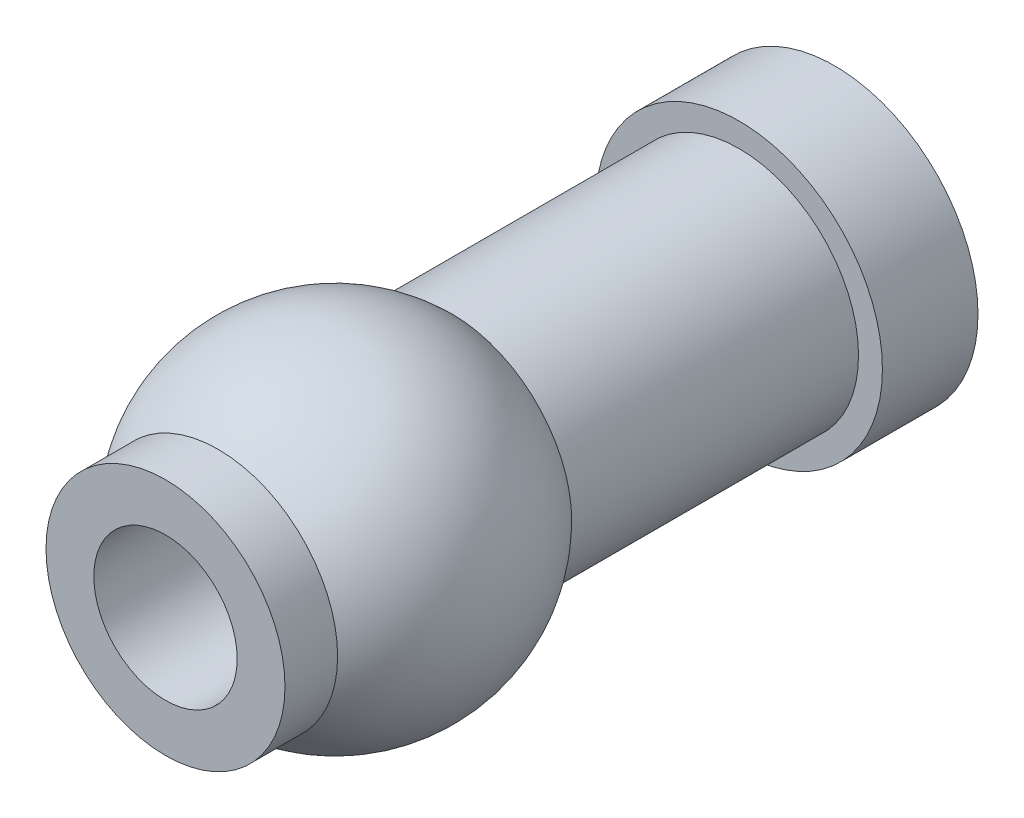
ISO-10303-21;
HEADER;
FILE_DESCRIPTION(('STEP AP214'),'2;1');
FILE_NAME('part.step','',(''),(''),'','','');
FILE_SCHEMA(('AUTOMOTIVE_DESIGN { 1 0 10303 214 1 1 1 1 }'));
ENDSEC;
DATA;
#1=APPLICATION_CONTEXT('core data for automotive mechanical design processes');
#2=APPLICATION_PROTOCOL_DEFINITION('international standard','automotive_design',2000,#1);
#3=PRODUCT_CONTEXT('',#1,'mechanical');
#4=PRODUCT('Part','Part','',(#3));
#5=PRODUCT_RELATED_PRODUCT_CATEGORY('part','',(#4));
#6=PRODUCT_DEFINITION_FORMATION('','',#4);
#7=PRODUCT_DEFINITION_CONTEXT('part definition',#1,'design');
#8=PRODUCT_DEFINITION('design','',#6,#7);
#9=PRODUCT_DEFINITION_SHAPE('','',#8);
#10=(LENGTH_UNIT() NAMED_UNIT(*) SI_UNIT(.MILLI.,.METRE.));
#11=(NAMED_UNIT(*) PLANE_ANGLE_UNIT() SI_UNIT($,.RADIAN.));
#12=(NAMED_UNIT(*) SI_UNIT($,.STERADIAN.) SOLID_ANGLE_UNIT());
#13=UNCERTAINTY_MEASURE_WITH_UNIT(LENGTH_MEASURE(1.E-05),#10,'distance_accuracy_value','');
#14=(GEOMETRIC_REPRESENTATION_CONTEXT(3) GLOBAL_UNCERTAINTY_ASSIGNED_CONTEXT((#13)) GLOBAL_UNIT_ASSIGNED_CONTEXT((#10,
#11,#12)) REPRESENTATION_CONTEXT('',''));
#15=CARTESIAN_POINT('',(0.,0.,0.));
#16=DIRECTION('',(0.,0.,1.));
#17=DIRECTION('',(1.,0.,0.));
#18=AXIS2_PLACEMENT_3D('',#15,#16,#17);
#19=CARTESIAN_POINT('',(0.,0.,0.));
#20=DIRECTION('',(0.,0.,1.));
#21=DIRECTION('',(1.,0.,0.));
#22=AXIS2_PLACEMENT_3D('',#19,#20,#21);
#23=CYLINDRICAL_SURFACE('',#22,1.5);
#24=CARTESIAN_POINT('',(0.,0.,0.));
#25=DIRECTION('',(0.,0.,1.));
#26=DIRECTION('',(1.,0.,0.));
#27=AXIS2_PLACEMENT_3D('',#24,#25,#26);
#28=CIRCLE('',#27,1.5);
#29=CARTESIAN_POINT('',(1.5,0.,0.));
#30=VERTEX_POINT('',#29);
#31=EDGE_CURVE('E61',#30,#30,#28,.T.);
#32=ORIENTED_EDGE('',*,*,#31,.T.);
#33=EDGE_LOOP('',(#32));
#34=FACE_BOUND('',#33,.T.);
#35=CARTESIAN_POINT('',(0.,0.,-14.));
#36=DIRECTION('',(0.,0.,1.));
#37=DIRECTION('',(1.,0.,0.));
#38=AXIS2_PLACEMENT_3D('',#35,#36,#37);
#39=CIRCLE('',#38,1.5);
#40=CARTESIAN_POINT('',(1.5,0.,-14.));
#41=VERTEX_POINT('',#40);
#42=EDGE_CURVE('E10',#41,#41,#39,.T.);
#43=ORIENTED_EDGE('',*,*,#42,.F.);
#44=EDGE_LOOP('',(#43));
#45=FACE_BOUND('',#44,.T.);
#46=ADVANCED_FACE('F33',(#34,#45),#23,.F.);
#47=CARTESIAN_POINT('',(0.,0.,-14.));
#48=DIRECTION('',(0.,0.,1.));
#49=DIRECTION('',(1.,0.,0.));
#50=AXIS2_PLACEMENT_3D('',#47,#48,#49);
#51=PLANE('',#50);
#52=CARTESIAN_POINT('',(0.,0.,-14.));
#53=DIRECTION('',(0.,0.,1.));
#54=DIRECTION('',(1.,0.,0.));
#55=AXIS2_PLACEMENT_3D('',#52,#53,#54);
#56=CIRCLE('',#55,3.);
#57=CARTESIAN_POINT('',(3.,0.,-14.));
#58=VERTEX_POINT('',#57);
#59=EDGE_CURVE('E39',#58,#58,#56,.T.);
#60=ORIENTED_EDGE('',*,*,#59,.F.);
#61=EDGE_LOOP('',(#60));
#62=FACE_BOUND('',#61,.T.);
#63=ORIENTED_EDGE('',*,*,#42,.T.);
#64=EDGE_LOOP('',(#63));
#65=FACE_BOUND('',#64,.T.);
#66=ADVANCED_FACE('F79',(#62,#65),#51,.F.);
#67=CARTESIAN_POINT('',(0.,0.,0.));
#68=DIRECTION('',(0.,0.,1.));
#69=DIRECTION('',(1.,0.,0.));
#70=AXIS2_PLACEMENT_3D('',#67,#68,#69);
#71=CYLINDRICAL_SURFACE('',#70,3.);
#72=CARTESIAN_POINT('',(0.,0.,-12.));
#73=DIRECTION('',(0.,0.,1.));
#74=DIRECTION('',(1.,0.,0.));
#75=AXIS2_PLACEMENT_3D('',#72,#73,#74);
#76=CIRCLE('',#75,3.);
#77=CARTESIAN_POINT('',(3.,0.,-12.));
#78=VERTEX_POINT('',#77);
#79=EDGE_CURVE('E43',#78,#78,#76,.T.);
#80=ORIENTED_EDGE('',*,*,#79,.F.);
#81=EDGE_LOOP('',(#80));
#82=FACE_BOUND('',#81,.T.);
#83=ORIENTED_EDGE('',*,*,#59,.T.);
#84=EDGE_LOOP('',(#83));
#85=FACE_BOUND('',#84,.T.);
#86=ADVANCED_FACE('F83',(#82,#85),#71,.T.);
#87=CARTESIAN_POINT('',(0.,0.,-12.));
#88=DIRECTION('',(0.,0.,-1.));
#89=DIRECTION('',(-1.,0.,0.));
#90=AXIS2_PLACEMENT_3D('',#87,#88,#89);
#91=PLANE('',#90);
#92=CARTESIAN_POINT('',(0.,0.,-12.));
#93=DIRECTION('',(0.,0.,1.));
#94=DIRECTION('',(1.,0.,0.));
#95=AXIS2_PLACEMENT_3D('',#92,#93,#94);
#96=CIRCLE('',#95,2.5);
#97=CARTESIAN_POINT('',(2.5,0.,-12.));
#98=VERTEX_POINT('',#97);
#99=EDGE_CURVE('E47',#98,#98,#96,.T.);
#100=ORIENTED_EDGE('',*,*,#99,.F.);
#101=EDGE_LOOP('',(#100));
#102=FACE_BOUND('',#101,.T.);
#103=ORIENTED_EDGE('',*,*,#79,.T.);
#104=EDGE_LOOP('',(#103));
#105=FACE_BOUND('',#104,.T.);
#106=ADVANCED_FACE('F88',(#102,#105),#91,.F.);
#107=CARTESIAN_POINT('',(0.,0.,0.));
#108=DIRECTION('',(0.,0.,1.));
#109=DIRECTION('',(1.,0.,0.));
#110=AXIS2_PLACEMENT_3D('',#107,#108,#109);
#111=CYLINDRICAL_SURFACE('',#110,2.5);
#112=CARTESIAN_POINT('',(0.,0.,-6.));
#113=DIRECTION('',(0.,0.,1.));
#114=DIRECTION('',(1.,0.,0.));
#115=AXIS2_PLACEMENT_3D('',#112,#113,#114);
#116=CIRCLE('',#115,2.5);
#117=CARTESIAN_POINT('',(2.5,0.,-6.));
#118=VERTEX_POINT('',#117);
#119=EDGE_CURVE('E52',#118,#118,#116,.T.);
#120=ORIENTED_EDGE('',*,*,#119,.F.);
#121=EDGE_LOOP('',(#120));
#122=FACE_BOUND('',#121,.T.);
#123=ORIENTED_EDGE('',*,*,#99,.T.);
#124=EDGE_LOOP('',(#123));
#125=FACE_BOUND('',#124,.T.);
#126=ADVANCED_FACE('F94',(#122,#125),#111,.T.);
#127=CARTESIAN_POINT('',(0.,0.,-3.55051025721682));
#128=DIRECTION('',(0.,0.,1.));
#129=DIRECTION('',(0.,1.,0.));
#130=AXIS2_PLACEMENT_3D('',#127,#128,#129);
#131=SPHERICAL_SURFACE('',#130,3.5);
#132=CARTESIAN_POINT('',(0.,0.,-1.10102051443364));
#133=DIRECTION('',(0.,0.,1.));
#134=DIRECTION('',(1.,0.,0.));
#135=AXIS2_PLACEMENT_3D('',#132,#133,#134);
#136=CIRCLE('',#135,2.5);
#137=CARTESIAN_POINT('',(2.5,0.,-1.10102051443364));
#138=VERTEX_POINT('',#137);
#139=EDGE_CURVE('E55',#138,#138,#136,.T.);
#140=ORIENTED_EDGE('',*,*,#139,.F.);
#141=EDGE_LOOP('',(#140));
#142=FACE_BOUND('',#141,.T.);
#143=ORIENTED_EDGE('',*,*,#119,.T.);
#144=EDGE_LOOP('',(#143));
#145=FACE_BOUND('',#144,.T.);
#146=ADVANCED_FACE('F75',(#142,#145),#131,.T.);
#147=CARTESIAN_POINT('',(0.,0.,0.));
#148=DIRECTION('',(0.,0.,1.));
#149=DIRECTION('',(1.,0.,0.));
#150=AXIS2_PLACEMENT_3D('',#147,#148,#149);
#151=CYLINDRICAL_SURFACE('',#150,2.5);
#152=ORIENTED_EDGE('',*,*,#139,.T.);
#153=EDGE_LOOP('',(#152));
#154=FACE_BOUND('',#153,.T.);
#155=CARTESIAN_POINT('',(0.,0.,0.));
#156=DIRECTION('',(0.,0.,1.));
#157=DIRECTION('',(1.,0.,0.));
#158=AXIS2_PLACEMENT_3D('',#155,#156,#157);
#159=CIRCLE('',#158,2.5);
#160=CARTESIAN_POINT('',(2.5,0.,0.));
#161=VERTEX_POINT('',#160);
#162=EDGE_CURVE('E58',#161,#161,#159,.T.);
#163=ORIENTED_EDGE('',*,*,#162,.F.);
#164=EDGE_LOOP('',(#163));
#165=FACE_BOUND('',#164,.T.);
#166=ADVANCED_FACE('F69',(#154,#165),#151,.T.);
#167=CARTESIAN_POINT('',(0.,0.,0.));
#168=DIRECTION('',(0.,0.,1.));
#169=DIRECTION('',(1.,0.,0.));
#170=AXIS2_PLACEMENT_3D('',#167,#168,#169);
#171=PLANE('',#170);
#172=ORIENTED_EDGE('',*,*,#162,.T.);
#173=EDGE_LOOP('',(#172));
#174=FACE_BOUND('',#173,.T.);
#175=ORIENTED_EDGE('',*,*,#31,.F.);
#176=EDGE_LOOP('',(#175));
#177=FACE_BOUND('',#176,.T.);
#178=ADVANCED_FACE('F67',(#174,#177),#171,.T.);
#179=CLOSED_SHELL('',(#46,#66,#86,#106,#126,#146,#166,#178));
#180=MANIFOLD_SOLID_BREP('B2',#179);
#181=ADVANCED_BREP_SHAPE_REPRESENTATION('',(#18,#180),#14);
#182=SHAPE_DEFINITION_REPRESENTATION(#9,#181);
ENDSEC;
END-ISO-10303-21;
